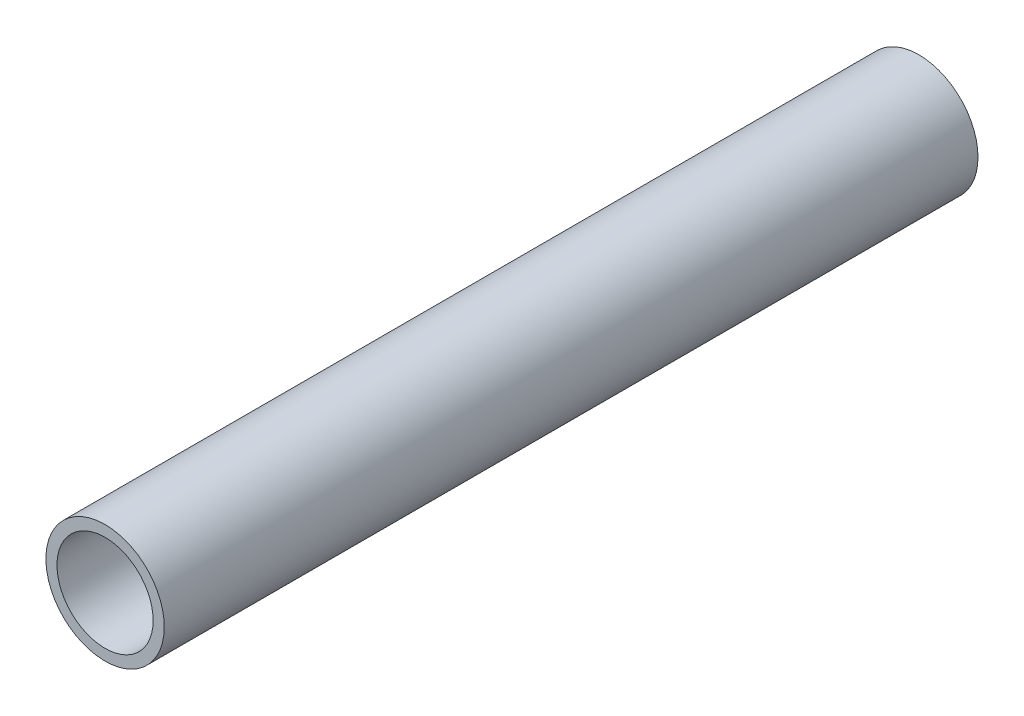
ISO-10303-21;
HEADER;
FILE_DESCRIPTION(('STEP AP214'),'2;1');
FILE_NAME('part.step','',(''),(''),'','','');
FILE_SCHEMA(('AUTOMOTIVE_DESIGN { 1 0 10303 214 1 1 1 1 }'));
ENDSEC;
DATA;
#1=APPLICATION_CONTEXT('core data for automotive mechanical design processes');
#2=APPLICATION_PROTOCOL_DEFINITION('international standard','automotive_design',2000,#1);
#3=PRODUCT_CONTEXT('',#1,'mechanical');
#4=PRODUCT('Part','Part','',(#3));
#5=PRODUCT_RELATED_PRODUCT_CATEGORY('part','',(#4));
#6=PRODUCT_DEFINITION_FORMATION('','',#4);
#7=PRODUCT_DEFINITION_CONTEXT('part definition',#1,'design');
#8=PRODUCT_DEFINITION('design','',#6,#7);
#9=PRODUCT_DEFINITION_SHAPE('','',#8);
#10=(LENGTH_UNIT() NAMED_UNIT(*) SI_UNIT(.MILLI.,.METRE.));
#11=(NAMED_UNIT(*) PLANE_ANGLE_UNIT() SI_UNIT($,.RADIAN.));
#12=(NAMED_UNIT(*) SI_UNIT($,.STERADIAN.) SOLID_ANGLE_UNIT());
#13=UNCERTAINTY_MEASURE_WITH_UNIT(LENGTH_MEASURE(1.E-05),#10,'distance_accuracy_value','');
#14=(GEOMETRIC_REPRESENTATION_CONTEXT(3) GLOBAL_UNCERTAINTY_ASSIGNED_CONTEXT((#13)) GLOBAL_UNIT_ASSIGNED_CONTEXT((#10,
#11,#12)) REPRESENTATION_CONTEXT('',''));
#15=CARTESIAN_POINT('',(0.,0.,0.));
#16=DIRECTION('',(0.,0.,1.));
#17=DIRECTION('',(1.,0.,0.));
#18=AXIS2_PLACEMENT_3D('',#15,#16,#17);
#19=CARTESIAN_POINT('',(0.,0.,55.));
#20=DIRECTION('',(0.,0.,1.));
#21=DIRECTION('',(1.,0.,0.));
#22=AXIS2_PLACEMENT_3D('',#19,#20,#21);
#23=PLANE('',#22);
#24=CARTESIAN_POINT('',(0.,0.,55.));
#25=DIRECTION('',(0.,0.,1.));
#26=DIRECTION('',(1.,0.,0.));
#27=AXIS2_PLACEMENT_3D('',#24,#25,#26);
#28=CIRCLE('',#27,4.);
#29=CARTESIAN_POINT('',(4.,0.,55.));
#30=VERTEX_POINT('',#29);
#31=EDGE_CURVE('E10',#30,#30,#28,.T.);
#32=ORIENTED_EDGE('',*,*,#31,.T.);
#33=EDGE_LOOP('',(#32));
#34=FACE_BOUND('',#33,.T.);
#35=CARTESIAN_POINT('',(0.,0.,55.));
#36=DIRECTION('',(0.,0.,1.));
#37=DIRECTION('',(1.,0.,0.));
#38=AXIS2_PLACEMENT_3D('',#35,#36,#37);
#39=CIRCLE('',#38,3.25);
#40=CARTESIAN_POINT('',(3.25,0.,55.));
#41=VERTEX_POINT('',#40);
#42=EDGE_CURVE('E42',#41,#41,#39,.T.);
#43=ORIENTED_EDGE('',*,*,#42,.F.);
#44=EDGE_LOOP('',(#43));
#45=FACE_BOUND('',#44,.T.);
#46=ADVANCED_FACE('F31',(#34,#45),#23,.T.);
#47=CARTESIAN_POINT('',(0.,0.,0.));
#48=DIRECTION('',(0.,0.,1.));
#49=DIRECTION('',(1.,0.,0.));
#50=AXIS2_PLACEMENT_3D('',#47,#48,#49);
#51=PLANE('',#50);
#52=CARTESIAN_POINT('',(0.,0.,0.));
#53=DIRECTION('',(0.,0.,1.));
#54=DIRECTION('',(1.,0.,0.));
#55=AXIS2_PLACEMENT_3D('',#52,#53,#54);
#56=CIRCLE('',#55,4.);
#57=CARTESIAN_POINT('',(4.,0.,0.));
#58=VERTEX_POINT('',#57);
#59=EDGE_CURVE('E35',#58,#58,#56,.T.);
#60=ORIENTED_EDGE('',*,*,#59,.F.);
#61=EDGE_LOOP('',(#60));
#62=FACE_BOUND('',#61,.T.);
#63=CARTESIAN_POINT('',(0.,0.,0.));
#64=DIRECTION('',(0.,0.,1.));
#65=DIRECTION('',(1.,0.,0.));
#66=AXIS2_PLACEMENT_3D('',#63,#64,#65);
#67=CIRCLE('',#66,3.25);
#68=CARTESIAN_POINT('',(3.25,0.,0.));
#69=VERTEX_POINT('',#68);
#70=EDGE_CURVE('E44',#69,#69,#67,.T.);
#71=ORIENTED_EDGE('',*,*,#70,.T.);
#72=EDGE_LOOP('',(#71));
#73=FACE_BOUND('',#72,.T.);
#74=ADVANCED_FACE('F54',(#62,#73),#51,.F.);
#75=CARTESIAN_POINT('',(0.,0.,55.));
#76=DIRECTION('',(0.,0.,-1.));
#77=DIRECTION('',(-1.,0.,0.));
#78=AXIS2_PLACEMENT_3D('',#75,#76,#77);
#79=CYLINDRICAL_SURFACE('',#78,4.);
#80=ORIENTED_EDGE('',*,*,#31,.F.);
#81=EDGE_LOOP('',(#80));
#82=FACE_BOUND('',#81,.T.);
#83=ORIENTED_EDGE('',*,*,#59,.T.);
#84=EDGE_LOOP('',(#83));
#85=FACE_BOUND('',#84,.T.);
#86=ADVANCED_FACE('F33',(#82,#85),#79,.T.);
#87=CARTESIAN_POINT('',(0.,0.,55.));
#88=DIRECTION('',(0.,0.,-1.));
#89=DIRECTION('',(-1.,0.,0.));
#90=AXIS2_PLACEMENT_3D('',#87,#88,#89);
#91=CYLINDRICAL_SURFACE('',#90,3.25);
#92=ORIENTED_EDGE('',*,*,#42,.T.);
#93=EDGE_LOOP('',(#92));
#94=FACE_BOUND('',#93,.T.);
#95=ORIENTED_EDGE('',*,*,#70,.F.);
#96=EDGE_LOOP('',(#95));
#97=FACE_BOUND('',#96,.T.);
#98=ADVANCED_FACE('F50',(#94,#97),#91,.F.);
#99=CLOSED_SHELL('',(#46,#74,#86,#98));
#100=MANIFOLD_SOLID_BREP('B2',#99);
#101=ADVANCED_BREP_SHAPE_REPRESENTATION('',(#18,#100),#14);
#102=SHAPE_DEFINITION_REPRESENTATION(#9,#101);
ENDSEC;
END-ISO-10303-21;
